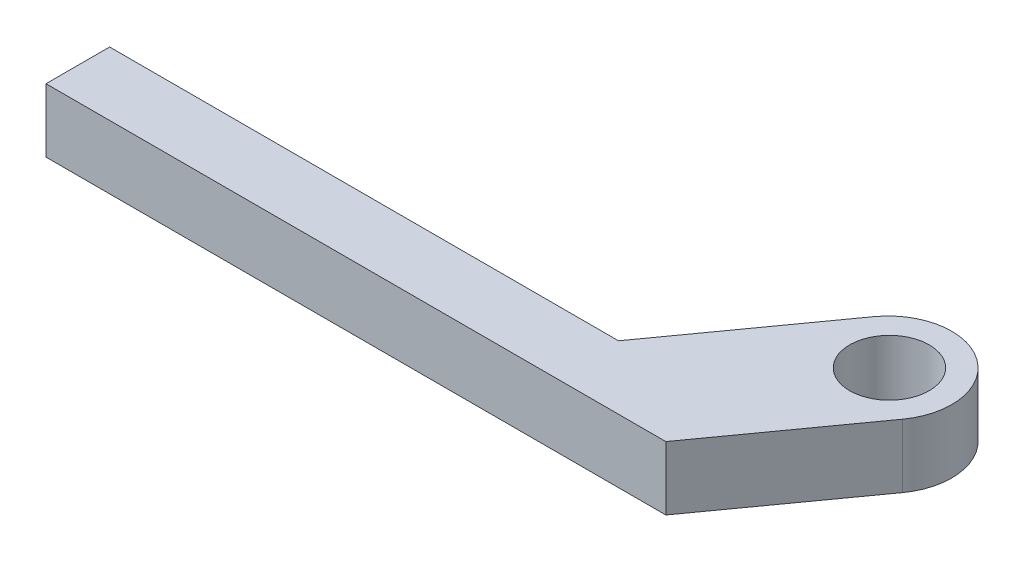
ISO-10303-21;
HEADER;
FILE_DESCRIPTION(('STEP AP214'),'2;1');
FILE_NAME('part.step','',(''),(''),'','','');
FILE_SCHEMA(('AUTOMOTIVE_DESIGN { 1 0 10303 214 1 1 1 1 }'));
ENDSEC;
DATA;
#1=APPLICATION_CONTEXT('core data for automotive mechanical design processes');
#2=APPLICATION_PROTOCOL_DEFINITION('international standard','automotive_design',2000,#1);
#3=PRODUCT_CONTEXT('',#1,'mechanical');
#4=PRODUCT('Part','Part','',(#3));
#5=PRODUCT_RELATED_PRODUCT_CATEGORY('part','',(#4));
#6=PRODUCT_DEFINITION_FORMATION('','',#4);
#7=PRODUCT_DEFINITION_CONTEXT('part definition',#1,'design');
#8=PRODUCT_DEFINITION('design','',#6,#7);
#9=PRODUCT_DEFINITION_SHAPE('','',#8);
#10=(LENGTH_UNIT() NAMED_UNIT(*) SI_UNIT(.MILLI.,.METRE.));
#11=(NAMED_UNIT(*) PLANE_ANGLE_UNIT() SI_UNIT($,.RADIAN.));
#12=(NAMED_UNIT(*) SI_UNIT($,.STERADIAN.) SOLID_ANGLE_UNIT());
#13=UNCERTAINTY_MEASURE_WITH_UNIT(LENGTH_MEASURE(1.E-05),#10,'distance_accuracy_value','');
#14=(GEOMETRIC_REPRESENTATION_CONTEXT(3) GLOBAL_UNCERTAINTY_ASSIGNED_CONTEXT((#13)) GLOBAL_UNIT_ASSIGNED_CONTEXT((#10,
#11,#12)) REPRESENTATION_CONTEXT('',''));
#15=CARTESIAN_POINT('',(0.,0.,0.));
#16=DIRECTION('',(0.,0.,1.));
#17=DIRECTION('',(1.,0.,0.));
#18=AXIS2_PLACEMENT_3D('',#15,#16,#17);
#19=CARTESIAN_POINT('',(5.16334827051863,6.35,24.1304782421103));
#20=DIRECTION('',(0.,-1.,0.));
#21=DIRECTION('',(0.,0.,-1.));
#22=AXIS2_PLACEMENT_3D('',#19,#20,#21);
#23=CYLINDRICAL_SURFACE('',#22,6.35);
#24=CARTESIAN_POINT('',(5.16334827051863,0.,24.1304782421103));
#25=DIRECTION('',(0.,1.,0.));
#26=DIRECTION('',(0.,0.,-1.));
#27=AXIS2_PLACEMENT_3D('',#24,#25,#26);
#28=CIRCLE('',#27,6.35);
#29=CARTESIAN_POINT('',(10.3204500407829,0.,27.8354480572555));
#30=VERTEX_POINT('',#29);
#31=CARTESIAN_POINT('',(0.00624650025432289,0.,20.4255084269652));
#32=VERTEX_POINT('',#31);
#33=EDGE_CURVE('E138',#30,#32,#28,.T.);
#34=ORIENTED_EDGE('',*,*,#33,.T.);
#35=DIRECTION('',(0.,-1.,0.));
#36=VECTOR('',#35,1.);
#37=CARTESIAN_POINT('',(0.00624650025432289,6.35,20.4255084269652));
#38=LINE('',#37,#36);
#39=CARTESIAN_POINT('',(0.00624650025432289,6.35,20.4255084269652));
#40=VERTEX_POINT('',#39);
#41=EDGE_CURVE('E11',#40,#32,#38,.T.);
#42=ORIENTED_EDGE('',*,*,#41,.F.);
#43=CARTESIAN_POINT('',(5.16334827051863,6.35,24.1304782421103));
#44=DIRECTION('',(0.,1.,0.));
#45=DIRECTION('',(0.,0.,-1.));
#46=AXIS2_PLACEMENT_3D('',#43,#44,#45);
#47=CIRCLE('',#46,6.35);
#48=CARTESIAN_POINT('',(10.3204500407829,6.35,27.8354480572555));
#49=VERTEX_POINT('',#48);
#50=EDGE_CURVE('E155',#49,#40,#47,.T.);
#51=ORIENTED_EDGE('',*,*,#50,.F.);
#52=DIRECTION('',(0.,-1.,0.));
#53=VECTOR('',#52,1.);
#54=CARTESIAN_POINT('',(10.3204500407829,6.35,27.8354480572555));
#55=LINE('',#54,#53);
#56=EDGE_CURVE('E134',#49,#30,#55,.T.);
#57=ORIENTED_EDGE('',*,*,#56,.T.);
#58=EDGE_LOOP('',(#34,#42,#51,#57));
#59=FACE_BOUND('',#58,.T.);
#60=ADVANCED_FACE('F49',(#59),#23,.T.);
#61=CARTESIAN_POINT('',(-10.638933844737,6.35,35.2429782421104));
#62=DIRECTION('',(0.812142011065245,0.,0.583459813408687));
#63=DIRECTION('',(0.583459813408687,0.,-0.812142011065245));
#64=AXIS2_PLACEMENT_3D('',#61,#62,#63);
#65=PLANE('',#64);
#66=DIRECTION('',(-0.583459813408687,0.,0.812142011065245));
#67=VECTOR('',#66,1.);
#68=CARTESIAN_POINT('',(-10.638933844737,0.,35.2429782421104));
#69=LINE('',#68,#67);
#70=CARTESIAN_POINT('',(-10.638933844737,0.,35.2429782421104));
#71=VERTEX_POINT('',#70);
#72=EDGE_CURVE('E142',#32,#71,#69,.T.);
#73=ORIENTED_EDGE('',*,*,#72,.T.);
#74=DIRECTION('',(0.,-1.,0.));
#75=VECTOR('',#74,1.);
#76=CARTESIAN_POINT('',(-10.638933844737,6.35,35.2429782421104));
#77=LINE('',#76,#75);
#78=CARTESIAN_POINT('',(-10.638933844737,6.35,35.2429782421104));
#79=VERTEX_POINT('',#78);
#80=EDGE_CURVE('E58',#79,#71,#77,.T.);
#81=ORIENTED_EDGE('',*,*,#80,.F.);
#82=DIRECTION('',(-0.583459813408687,0.,0.812142011065245));
#83=VECTOR('',#82,1.);
#84=CARTESIAN_POINT('',(-10.638933844737,6.35,35.2429782421104));
#85=LINE('',#84,#83);
#86=EDGE_CURVE('E102',#40,#79,#85,.T.);
#87=ORIENTED_EDGE('',*,*,#86,.F.);
#88=ORIENTED_EDGE('',*,*,#41,.T.);
#89=EDGE_LOOP('',(#73,#81,#87,#88));
#90=FACE_BOUND('',#89,.T.);
#91=ADVANCED_FACE('F185',(#90),#65,.F.);
#92=CARTESIAN_POINT('',(-61.438933844737,6.35,35.2429782421104));
#93=DIRECTION('',(0.,0.,1.));
#94=DIRECTION('',(1.,0.,0.));
#95=AXIS2_PLACEMENT_3D('',#92,#93,#94);
#96=PLANE('',#95);
#97=DIRECTION('',(-1.,0.,0.));
#98=VECTOR('',#97,1.);
#99=CARTESIAN_POINT('',(-61.438933844737,0.,35.2429782421104));
#100=LINE('',#99,#98);
#101=CARTESIAN_POINT('',(-61.438933844737,0.,35.2429782421104));
#102=VERTEX_POINT('',#101);
#103=EDGE_CURVE('E146',#71,#102,#100,.T.);
#104=ORIENTED_EDGE('',*,*,#103,.T.);
#105=DIRECTION('',(0.,-1.,0.));
#106=VECTOR('',#105,1.);
#107=CARTESIAN_POINT('',(-61.438933844737,6.35,35.2429782421104));
#108=LINE('',#107,#106);
#109=CARTESIAN_POINT('',(-61.438933844737,6.35,35.2429782421104));
#110=VERTEX_POINT('',#109);
#111=EDGE_CURVE('E127',#110,#102,#108,.T.);
#112=ORIENTED_EDGE('',*,*,#111,.F.);
#113=DIRECTION('',(-1.,0.,0.));
#114=VECTOR('',#113,1.);
#115=CARTESIAN_POINT('',(-61.438933844737,6.35,35.2429782421104));
#116=LINE('',#115,#114);
#117=EDGE_CURVE('E115',#79,#110,#116,.T.);
#118=ORIENTED_EDGE('',*,*,#117,.F.);
#119=ORIENTED_EDGE('',*,*,#80,.T.);
#120=EDGE_LOOP('',(#104,#112,#118,#119));
#121=FACE_BOUND('',#120,.T.);
#122=ADVANCED_FACE('F165',(#121),#96,.F.);
#123=CARTESIAN_POINT('',(-61.438933844737,6.35,41.5929782421104));
#124=DIRECTION('',(1.,0.,0.));
#125=DIRECTION('',(0.,0.,-1.));
#126=AXIS2_PLACEMENT_3D('',#123,#124,#125);
#127=PLANE('',#126);
#128=DIRECTION('',(0.,0.,1.));
#129=VECTOR('',#128,1.);
#130=CARTESIAN_POINT('',(-61.438933844737,0.,41.5929782421104));
#131=LINE('',#130,#129);
#132=CARTESIAN_POINT('',(-61.438933844737,0.,41.5929782421104));
#133=VERTEX_POINT('',#132);
#134=EDGE_CURVE('E125',#102,#133,#131,.T.);
#135=ORIENTED_EDGE('',*,*,#134,.T.);
#136=DIRECTION('',(0.,-1.,0.));
#137=VECTOR('',#136,1.);
#138=CARTESIAN_POINT('',(-61.438933844737,6.35,41.5929782421104));
#139=LINE('',#138,#137);
#140=CARTESIAN_POINT('',(-61.438933844737,6.35,41.5929782421104));
#141=VERTEX_POINT('',#140);
#142=EDGE_CURVE('E122',#141,#133,#139,.T.);
#143=ORIENTED_EDGE('',*,*,#142,.F.);
#144=DIRECTION('',(0.,0.,1.));
#145=VECTOR('',#144,1.);
#146=CARTESIAN_POINT('',(-61.438933844737,6.35,41.5929782421104));
#147=LINE('',#146,#145);
#148=EDGE_CURVE('E109',#110,#141,#147,.T.);
#149=ORIENTED_EDGE('',*,*,#148,.F.);
#150=ORIENTED_EDGE('',*,*,#111,.T.);
#151=EDGE_LOOP('',(#135,#143,#149,#150));
#152=FACE_BOUND('',#151,.T.);
#153=ADVANCED_FACE('F123',(#152),#127,.F.);
#154=CARTESIAN_POINT('',(-10.638933844737,6.35,41.5929782421104));
#155=DIRECTION('',(0.,0.,-1.));
#156=DIRECTION('',(-1.,0.,0.));
#157=AXIS2_PLACEMENT_3D('',#154,#155,#156);
#158=PLANE('',#157);
#159=DIRECTION('',(1.,0.,0.));
#160=VECTOR('',#159,1.);
#161=CARTESIAN_POINT('',(-10.638933844737,0.,41.5929782421104));
#162=LINE('',#161,#160);
#163=CARTESIAN_POINT('',(0.436752503585916,0.,41.5929782421104));
#164=VERTEX_POINT('',#163);
#165=EDGE_CURVE('E88',#133,#164,#162,.T.);
#166=ORIENTED_EDGE('',*,*,#165,.T.);
#167=DIRECTION('',(0.,-1.,0.));
#168=VECTOR('',#167,1.);
#169=CARTESIAN_POINT('',(0.436752503585916,6.35,41.5929782421104));
#170=LINE('',#169,#168);
#171=CARTESIAN_POINT('',(0.436752503585916,6.35,41.5929782421104));
#172=VERTEX_POINT('',#171);
#173=EDGE_CURVE('E128',#172,#164,#170,.T.);
#174=ORIENTED_EDGE('',*,*,#173,.F.);
#175=DIRECTION('',(1.,0.,0.));
#176=VECTOR('',#175,1.);
#177=CARTESIAN_POINT('',(-61.438933844737,6.35,41.5929782421104));
#178=LINE('',#177,#176);
#179=EDGE_CURVE('E113',#141,#172,#178,.T.);
#180=ORIENTED_EDGE('',*,*,#179,.F.);
#181=ORIENTED_EDGE('',*,*,#142,.T.);
#182=EDGE_LOOP('',(#166,#174,#180,#181));
#183=FACE_BOUND('',#182,.T.);
#184=ADVANCED_FACE('F130',(#183),#158,.F.);
#185=CARTESIAN_POINT('',(10.3204500407829,6.35,27.8354480572555));
#186=DIRECTION('',(-0.812142011065245,0.,-0.583459813408687));
#187=DIRECTION('',(-0.583459813408687,0.,0.812142011065245));
#188=AXIS2_PLACEMENT_3D('',#185,#186,#187);
#189=PLANE('',#188);
#190=DIRECTION('',(0.583459813408687,0.,-0.812142011065245));
#191=VECTOR('',#190,1.);
#192=CARTESIAN_POINT('',(10.3204500407829,0.,27.8354480572555));
#193=LINE('',#192,#191);
#194=EDGE_CURVE('E94',#164,#30,#193,.T.);
#195=ORIENTED_EDGE('',*,*,#194,.T.);
#196=ORIENTED_EDGE('',*,*,#56,.F.);
#197=DIRECTION('',(0.583459813408687,0.,-0.812142011065245));
#198=VECTOR('',#197,1.);
#199=CARTESIAN_POINT('',(10.3204500407829,6.35,27.8354480572555));
#200=LINE('',#199,#198);
#201=EDGE_CURVE('E66',#172,#49,#200,.T.);
#202=ORIENTED_EDGE('',*,*,#201,.F.);
#203=ORIENTED_EDGE('',*,*,#173,.T.);
#204=EDGE_LOOP('',(#195,#196,#202,#203));
#205=FACE_BOUND('',#204,.T.);
#206=ADVANCED_FACE('F172',(#205),#189,.F.);
#207=CARTESIAN_POINT('',(5.16334827051863,6.35,24.1304782421103));
#208=DIRECTION('',(0.,-1.,0.));
#209=DIRECTION('',(0.,0.,-1.));
#210=AXIS2_PLACEMENT_3D('',#207,#208,#209);
#211=PLANE('',#210);
#212=CARTESIAN_POINT('',(5.21873979549699,6.35,24.053376471846));
#213=DIRECTION('',(0.,1.,0.));
#214=DIRECTION('',(0.,0.,1.));
#215=AXIS2_PLACEMENT_3D('',#212,#213,#214);
#216=CIRCLE('',#215,3.96875);
#217=CARTESIAN_POINT('',(5.21873979549699,6.35,28.022126471846));
#218=VERTEX_POINT('',#217);
#219=EDGE_CURVE('E250',#218,#218,#216,.T.);
#220=ORIENTED_EDGE('',*,*,#219,.F.);
#221=EDGE_LOOP('',(#220));
#222=FACE_BOUND('',#221,.T.);
#223=ORIENTED_EDGE('',*,*,#50,.T.);
#224=ORIENTED_EDGE('',*,*,#86,.T.);
#225=ORIENTED_EDGE('',*,*,#117,.T.);
#226=ORIENTED_EDGE('',*,*,#148,.T.);
#227=ORIENTED_EDGE('',*,*,#179,.T.);
#228=ORIENTED_EDGE('',*,*,#201,.T.);
#229=EDGE_LOOP('',(#223,#224,#225,#226,#227,#228));
#230=FACE_BOUND('',#229,.T.);
#231=ADVANCED_FACE('F111',(#222,#230),#211,.F.);
#232=CARTESIAN_POINT('',(5.16334827051863,0.,24.1304782421103));
#233=DIRECTION('',(0.,-1.,0.));
#234=DIRECTION('',(0.,0.,-1.));
#235=AXIS2_PLACEMENT_3D('',#232,#233,#234);
#236=PLANE('',#235);
#237=CARTESIAN_POINT('',(5.21873979549699,0.,24.053376471846));
#238=DIRECTION('',(0.,1.,0.));
#239=DIRECTION('',(0.,0.,1.));
#240=AXIS2_PLACEMENT_3D('',#237,#238,#239);
#241=CIRCLE('',#240,3.96875);
#242=CARTESIAN_POINT('',(5.21873979549699,0.,28.022126471846));
#243=VERTEX_POINT('',#242);
#244=EDGE_CURVE('E143',#243,#243,#241,.T.);
#245=ORIENTED_EDGE('',*,*,#244,.T.);
#246=EDGE_LOOP('',(#245));
#247=FACE_BOUND('',#246,.T.);
#248=ORIENTED_EDGE('',*,*,#33,.F.);
#249=ORIENTED_EDGE('',*,*,#194,.F.);
#250=ORIENTED_EDGE('',*,*,#165,.F.);
#251=ORIENTED_EDGE('',*,*,#134,.F.);
#252=ORIENTED_EDGE('',*,*,#103,.F.);
#253=ORIENTED_EDGE('',*,*,#72,.F.);
#254=EDGE_LOOP('',(#248,#249,#250,#251,#252,#253));
#255=FACE_BOUND('',#254,.T.);
#256=ADVANCED_FACE('F168',(#247,#255),#236,.T.);
#257=CARTESIAN_POINT('',(5.21873979549699,6.35,24.053376471846));
#258=DIRECTION('',(0.,1.,0.));
#259=DIRECTION('',(0.,0.,1.));
#260=AXIS2_PLACEMENT_3D('',#257,#258,#259);
#261=CYLINDRICAL_SURFACE('',#260,3.96875);
#262=ORIENTED_EDGE('',*,*,#244,.F.);
#263=EDGE_LOOP('',(#262));
#264=FACE_BOUND('',#263,.T.);
#265=ORIENTED_EDGE('',*,*,#219,.T.);
#266=EDGE_LOOP('',(#265));
#267=FACE_BOUND('',#266,.T.);
#268=ADVANCED_FACE('F227',(#264,#267),#261,.F.);
#269=CLOSED_SHELL('',(#60,#91,#122,#153,#184,#206,#231,#256,#268));
#270=MANIFOLD_SOLID_BREP('B2',#269);
#271=ADVANCED_BREP_SHAPE_REPRESENTATION('',(#18,#270),#14);
#272=SHAPE_DEFINITION_REPRESENTATION(#9,#271);
ENDSEC;
END-ISO-10303-21;
